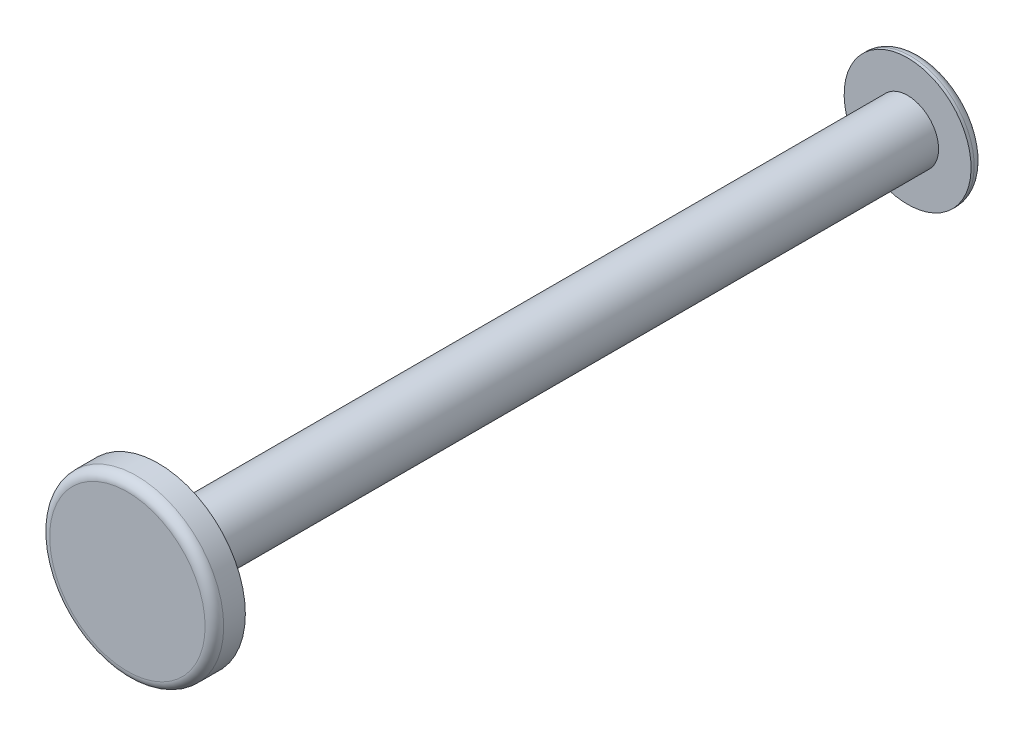
ISO-10303-21;
HEADER;
FILE_DESCRIPTION(('STEP AP214'),'2;1');
FILE_NAME('part.step','',(''),(''),'','','');
FILE_SCHEMA(('AUTOMOTIVE_DESIGN { 1 0 10303 214 1 1 1 1 }'));
ENDSEC;
DATA;
#1=APPLICATION_CONTEXT('core data for automotive mechanical design processes');
#2=APPLICATION_PROTOCOL_DEFINITION('international standard','automotive_design',2000,#1);
#3=PRODUCT_CONTEXT('',#1,'mechanical');
#4=PRODUCT('Part','Part','',(#3));
#5=PRODUCT_RELATED_PRODUCT_CATEGORY('part','',(#4));
#6=PRODUCT_DEFINITION_FORMATION('','',#4);
#7=PRODUCT_DEFINITION_CONTEXT('part definition',#1,'design');
#8=PRODUCT_DEFINITION('design','',#6,#7);
#9=PRODUCT_DEFINITION_SHAPE('','',#8);
#10=(LENGTH_UNIT() NAMED_UNIT(*) SI_UNIT(.MILLI.,.METRE.));
#11=(NAMED_UNIT(*) PLANE_ANGLE_UNIT() SI_UNIT($,.RADIAN.));
#12=(NAMED_UNIT(*) SI_UNIT($,.STERADIAN.) SOLID_ANGLE_UNIT());
#13=UNCERTAINTY_MEASURE_WITH_UNIT(LENGTH_MEASURE(1.E-05),#10,'distance_accuracy_value','');
#14=(GEOMETRIC_REPRESENTATION_CONTEXT(3) GLOBAL_UNCERTAINTY_ASSIGNED_CONTEXT((#13)) GLOBAL_UNIT_ASSIGNED_CONTEXT((#10,
#11,#12)) REPRESENTATION_CONTEXT('',''));
#15=CARTESIAN_POINT('',(0.,0.,0.));
#16=DIRECTION('',(0.,0.,1.));
#17=DIRECTION('',(1.,0.,0.));
#18=AXIS2_PLACEMENT_3D('',#15,#16,#17);
#19=CARTESIAN_POINT('',(-1.83302770289265E-13,17.5,-27.0284271247462));
#20=DIRECTION('',(0.,0.,1.));
#21=DIRECTION('',(1.,0.,0.));
#22=AXIS2_PLACEMENT_3D('',#19,#20,#21);
#23=CYLINDRICAL_SURFACE('',#22,1.);
#24=CARTESIAN_POINT('',(-1.83302770289265E-13,17.5,0.));
#25=DIRECTION('',(0.,0.,1.));
#26=DIRECTION('',(1.,0.,0.));
#27=AXIS2_PLACEMENT_3D('',#24,#25,#26);
#28=CIRCLE('',#27,1.);
#29=CARTESIAN_POINT('',(0.999999999999818,17.5,0.));
#30=VERTEX_POINT('',#29);
#31=EDGE_CURVE('E65',#30,#30,#28,.T.);
#32=ORIENTED_EDGE('',*,*,#31,.F.);
#33=EDGE_LOOP('',(#32));
#34=FACE_BOUND('',#33,.T.);
#35=CARTESIAN_POINT('',(-1.83302770289265E-13,17.5,-24.2));
#36=DIRECTION('',(0.,0.,-1.));
#37=DIRECTION('',(0.,1.,0.));
#38=AXIS2_PLACEMENT_3D('',#35,#36,#37);
#39=CIRCLE('',#38,1.);
#40=CARTESIAN_POINT('',(-1.83302770289265E-13,18.5,-24.2));
#41=VERTEX_POINT('',#40);
#42=EDGE_CURVE('E71',#41,#41,#39,.F.);
#43=ORIENTED_EDGE('',*,*,#42,.T.);
#44=EDGE_LOOP('',(#43));
#45=FACE_BOUND('',#44,.T.);
#46=ADVANCED_FACE('F41',(#34,#45),#23,.T.);
#47=CARTESIAN_POINT('',(-1.83302876458243E-13,17.5,1.));
#48=DIRECTION('',(0.,0.,-1.));
#49=DIRECTION('',(-1.,0.,0.));
#50=AXIS2_PLACEMENT_3D('',#47,#48,#49);
#51=CYLINDRICAL_SURFACE('',#50,2.81);
#52=CARTESIAN_POINT('',(-1.83302876458243E-13,17.5,0.7));
#53=DIRECTION('',(0.,0.,1.));
#54=DIRECTION('',(1.,0.,0.));
#55=AXIS2_PLACEMENT_3D('',#52,#53,#54);
#56=CIRCLE('',#55,2.81);
#57=CARTESIAN_POINT('',(2.80999999999982,17.5,0.7));
#58=VERTEX_POINT('',#57);
#59=EDGE_CURVE('E52',#58,#58,#56,.F.);
#60=ORIENTED_EDGE('',*,*,#59,.T.);
#61=EDGE_LOOP('',(#60));
#62=FACE_BOUND('',#61,.T.);
#63=CARTESIAN_POINT('',(-1.83302876458243E-13,17.5,0.));
#64=DIRECTION('',(0.,0.,1.));
#65=DIRECTION('',(1.,0.,0.));
#66=AXIS2_PLACEMENT_3D('',#63,#64,#65);
#67=CIRCLE('',#66,2.81);
#68=CARTESIAN_POINT('',(2.80999999999982,17.5,0.));
#69=VERTEX_POINT('',#68);
#70=EDGE_CURVE('E68',#69,#69,#67,.T.);
#71=ORIENTED_EDGE('',*,*,#70,.T.);
#72=EDGE_LOOP('',(#71));
#73=FACE_BOUND('',#72,.T.);
#74=ADVANCED_FACE('F95',(#62,#73),#51,.T.);
#75=CARTESIAN_POINT('',(-1.83302876458243E-13,17.5,1.));
#76=DIRECTION('',(0.,0.,1.));
#77=DIRECTION('',(1.,0.,0.));
#78=AXIS2_PLACEMENT_3D('',#75,#76,#77);
#79=PLANE('',#78);
#80=CARTESIAN_POINT('',(-1.83302876458243E-13,17.5,1.));
#81=DIRECTION('',(0.,0.,1.));
#82=DIRECTION('',(1.,0.,0.));
#83=AXIS2_PLACEMENT_3D('',#80,#81,#82);
#84=CIRCLE('',#83,2.51);
#85=CARTESIAN_POINT('',(2.50999999999982,17.5,1.));
#86=VERTEX_POINT('',#85);
#87=EDGE_CURVE('E56',#86,#86,#84,.T.);
#88=ORIENTED_EDGE('',*,*,#87,.T.);
#89=EDGE_LOOP('',(#88));
#90=FACE_BOUND('',#89,.T.);
#91=ADVANCED_FACE('F101',(#90),#79,.T.);
#92=CARTESIAN_POINT('',(-1.83302876458243E-13,17.5,0.));
#93=DIRECTION('',(0.,0.,1.));
#94=DIRECTION('',(1.,0.,0.));
#95=AXIS2_PLACEMENT_3D('',#92,#93,#94);
#96=PLANE('',#95);
#97=ORIENTED_EDGE('',*,*,#31,.T.);
#98=EDGE_LOOP('',(#97));
#99=FACE_BOUND('',#98,.T.);
#100=ORIENTED_EDGE('',*,*,#70,.F.);
#101=EDGE_LOOP('',(#100));
#102=FACE_BOUND('',#101,.T.);
#103=ADVANCED_FACE('F109',(#99,#102),#96,.F.);
#104=CARTESIAN_POINT('',(-1.83302876458243E-13,17.5,0.7));
#105=DIRECTION('',(0.,0.,1.));
#106=DIRECTION('',(1.,0.,0.));
#107=AXIS2_PLACEMENT_3D('',#104,#105,#106);
#108=TOROIDAL_SURFACE('',#107,2.51,0.3);
#109=ORIENTED_EDGE('',*,*,#59,.F.);
#110=EDGE_LOOP('',(#109));
#111=FACE_BOUND('',#110,.T.);
#112=ORIENTED_EDGE('',*,*,#87,.F.);
#113=EDGE_LOOP('',(#112));
#114=FACE_BOUND('',#113,.T.);
#115=ADVANCED_FACE('F107',(#111,#114),#108,.T.);
#116=CARTESIAN_POINT('',(-1.83942104411702E-13,17.5,-24.6));
#117=DIRECTION('',(0.,0.,1.));
#118=DIRECTION('',(0.,-1.,0.));
#119=AXIS2_PLACEMENT_3D('',#116,#117,#118);
#120=CYLINDRICAL_SURFACE('',#119,2.05);
#121=CARTESIAN_POINT('',(-1.83956936297422E-13,17.5,-24.3));
#122=DIRECTION('',(0.,0.,-1.));
#123=DIRECTION('',(0.,1.,0.));
#124=AXIS2_PLACEMENT_3D('',#121,#122,#123);
#125=CIRCLE('',#124,2.05);
#126=CARTESIAN_POINT('',(-1.83956936297422E-13,19.55,-24.3));
#127=VERTEX_POINT('',#126);
#128=EDGE_CURVE('E10',#127,#127,#125,.F.);
#129=ORIENTED_EDGE('',*,*,#128,.T.);
#130=EDGE_LOOP('',(#129));
#131=FACE_BOUND('',#130,.T.);
#132=CARTESIAN_POINT('',(-1.83961880259328E-13,17.5,-24.2));
#133=DIRECTION('',(0.,0.,-1.));
#134=DIRECTION('',(0.,1.,0.));
#135=AXIS2_PLACEMENT_3D('',#132,#133,#134);
#136=CIRCLE('',#135,2.05);
#137=CARTESIAN_POINT('',(-1.83961880259328E-13,19.55,-24.2));
#138=VERTEX_POINT('',#137);
#139=EDGE_CURVE('E61',#138,#138,#136,.T.);
#140=ORIENTED_EDGE('',*,*,#139,.T.);
#141=EDGE_LOOP('',(#140));
#142=FACE_BOUND('',#141,.T.);
#143=ADVANCED_FACE('F77',(#131,#142),#120,.T.);
#144=CARTESIAN_POINT('',(-1.83942104411702E-13,17.5,-24.6));
#145=DIRECTION('',(0.,0.,-1.));
#146=DIRECTION('',(0.,1.,0.));
#147=AXIS2_PLACEMENT_3D('',#144,#145,#146);
#148=PLANE('',#147);
#149=CARTESIAN_POINT('',(-1.83942104411702E-13,17.5,-24.6));
#150=DIRECTION('',(0.,0.,-1.));
#151=DIRECTION('',(0.,1.,0.));
#152=AXIS2_PLACEMENT_3D('',#149,#150,#151);
#153=CIRCLE('',#152,1.75);
#154=CARTESIAN_POINT('',(-1.83942104411702E-13,19.25,-24.6));
#155=VERTEX_POINT('',#154);
#156=EDGE_CURVE('E48',#155,#155,#153,.T.);
#157=ORIENTED_EDGE('',*,*,#156,.T.);
#158=EDGE_LOOP('',(#157));
#159=FACE_BOUND('',#158,.T.);
#160=CARTESIAN_POINT('',(-1.80730610840626E-13,17.5,-24.6));
#161=DIRECTION('',(0.,0.,-1.));
#162=DIRECTION('',(0.,1.,0.));
#163=AXIS2_PLACEMENT_3D('',#160,#161,#162);
#164=CIRCLE('',#163,1.);
#165=CARTESIAN_POINT('',(-1.80730610840626E-13,18.5,-24.6));
#166=VERTEX_POINT('',#165);
#167=EDGE_CURVE('E59',#166,#166,#164,.T.);
#168=ORIENTED_EDGE('',*,*,#167,.F.);
#169=EDGE_LOOP('',(#168));
#170=FACE_BOUND('',#169,.T.);
#171=ADVANCED_FACE('F82',(#159,#170),#148,.T.);
#172=CARTESIAN_POINT('',(-1.83961880259328E-13,17.5,-24.2));
#173=DIRECTION('',(0.,0.,-1.));
#174=DIRECTION('',(0.,1.,0.));
#175=AXIS2_PLACEMENT_3D('',#172,#173,#174);
#176=PLANE('',#175);
#177=ORIENTED_EDGE('',*,*,#42,.F.);
#178=EDGE_LOOP('',(#177));
#179=FACE_BOUND('',#178,.T.);
#180=ORIENTED_EDGE('',*,*,#139,.F.);
#181=EDGE_LOOP('',(#180));
#182=FACE_BOUND('',#181,.T.);
#183=ADVANCED_FACE('F79',(#179,#182),#176,.F.);
#184=CARTESIAN_POINT('',(-1.80730610840626E-13,17.5,-24.6));
#185=DIRECTION('',(0.918394914549332,0.395664985726466,0.));
#186=DIRECTION('',(-0.395664985726466,0.918394914549332,0.));
#187=AXIS2_PLACEMENT_3D('',#184,#185,#186);
#188=SPHERICAL_SURFACE('',#187,1.);
#189=CARTESIAN_POINT('',(-1.80730610840626E-13,17.5,-24.6));
#190=DIRECTION('',(0.,0.,-1.));
#191=DIRECTION('',(0.,1.,0.));
#192=AXIS2_PLACEMENT_3D('',#189,#190,#191);
#193=SPHERICAL_SURFACE('',#192,1.);
#194=ORIENTED_EDGE('',*,*,#167,.T.);
#195=EDGE_LOOP('',(#194));
#196=FACE_BOUND('',#195,.T.);
#197=ADVANCED_FACE('F81',(#196),#193,.F.);
#198=CARTESIAN_POINT('',(-1.83956936297422E-13,17.5,-24.3));
#199=DIRECTION('',(0.,0.,-1.));
#200=DIRECTION('',(0.,1.,0.));
#201=AXIS2_PLACEMENT_3D('',#198,#199,#200);
#202=TOROIDAL_SURFACE('',#201,1.75,0.3);
#203=ORIENTED_EDGE('',*,*,#128,.F.);
#204=EDGE_LOOP('',(#203));
#205=FACE_BOUND('',#204,.T.);
#206=ORIENTED_EDGE('',*,*,#156,.F.);
#207=EDGE_LOOP('',(#206));
#208=FACE_BOUND('',#207,.T.);
#209=ADVANCED_FACE('F43',(#205,#208),#202,.T.);
#210=CLOSED_SHELL('',(#46,#74,#91,#103,#115,#143,#171,#183,#197,#209));
#211=MANIFOLD_SOLID_BREP('B2',#210);
#212=ADVANCED_BREP_SHAPE_REPRESENTATION('',(#18,#211),#14);
#213=SHAPE_DEFINITION_REPRESENTATION(#9,#212);
ENDSEC;
END-ISO-10303-21;
